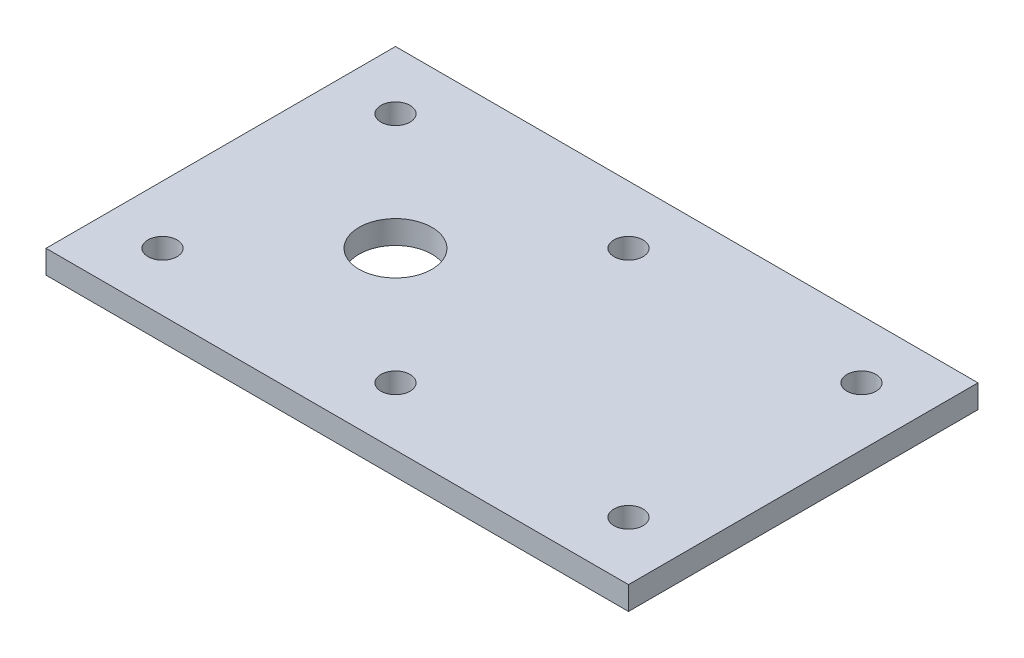
ISO-10303-21;
HEADER;
FILE_DESCRIPTION(('STEP AP214'),'2;1');
FILE_NAME('part.step','',(''),(''),'','','');
FILE_SCHEMA(('AUTOMOTIVE_DESIGN { 1 0 10303 214 1 1 1 1 }'));
ENDSEC;
DATA;
#1=APPLICATION_CONTEXT('core data for automotive mechanical design processes');
#2=APPLICATION_PROTOCOL_DEFINITION('international standard','automotive_design',2000,#1);
#3=PRODUCT_CONTEXT('',#1,'mechanical');
#4=PRODUCT('Part','Part','',(#3));
#5=PRODUCT_RELATED_PRODUCT_CATEGORY('part','',(#4));
#6=PRODUCT_DEFINITION_FORMATION('','',#4);
#7=PRODUCT_DEFINITION_CONTEXT('part definition',#1,'design');
#8=PRODUCT_DEFINITION('design','',#6,#7);
#9=PRODUCT_DEFINITION_SHAPE('','',#8);
#10=(LENGTH_UNIT() NAMED_UNIT(*) SI_UNIT(.MILLI.,.METRE.));
#11=(NAMED_UNIT(*) PLANE_ANGLE_UNIT() SI_UNIT($,.RADIAN.));
#12=(NAMED_UNIT(*) SI_UNIT($,.STERADIAN.) SOLID_ANGLE_UNIT());
#13=UNCERTAINTY_MEASURE_WITH_UNIT(LENGTH_MEASURE(1.E-05),#10,'distance_accuracy_value','');
#14=(GEOMETRIC_REPRESENTATION_CONTEXT(3) GLOBAL_UNCERTAINTY_ASSIGNED_CONTEXT((#13)) GLOBAL_UNIT_ASSIGNED_CONTEXT((#10,
#11,#12)) REPRESENTATION_CONTEXT('',''));
#15=CARTESIAN_POINT('',(0.,0.,0.));
#16=DIRECTION('',(0.,0.,1.));
#17=DIRECTION('',(1.,0.,0.));
#18=AXIS2_PLACEMENT_3D('',#15,#16,#17);
#19=CARTESIAN_POINT('',(120.,0.,40.));
#20=DIRECTION('',(0.,1.,0.));
#21=DIRECTION('',(0.,0.,1.));
#22=AXIS2_PLACEMENT_3D('',#19,#20,#21);
#23=CYLINDRICAL_SURFACE('',#22,5.);
#24=CARTESIAN_POINT('',(120.,0.,40.));
#25=DIRECTION('',(0.,1.,0.));
#26=DIRECTION('',(0.,0.,1.));
#27=AXIS2_PLACEMENT_3D('',#24,#25,#26);
#28=CIRCLE('',#27,5.);
#29=CARTESIAN_POINT('',(120.,0.,45.));
#30=VERTEX_POINT('',#29);
#31=EDGE_CURVE('E45',#30,#30,#28,.T.);
#32=ORIENTED_EDGE('',*,*,#31,.F.);
#33=EDGE_LOOP('',(#32));
#34=FACE_BOUND('',#33,.T.);
#35=CARTESIAN_POINT('',(120.,8.,40.));
#36=DIRECTION('',(0.,1.,0.));
#37=DIRECTION('',(0.,0.,1.));
#38=AXIS2_PLACEMENT_3D('',#35,#36,#37);
#39=CIRCLE('',#38,5.);
#40=CARTESIAN_POINT('',(120.,8.,45.));
#41=VERTEX_POINT('',#40);
#42=EDGE_CURVE('E11',#41,#41,#39,.T.);
#43=ORIENTED_EDGE('',*,*,#42,.T.);
#44=EDGE_LOOP('',(#43));
#45=FACE_BOUND('',#44,.T.);
#46=ADVANCED_FACE('F36',(#34,#45),#23,.F.);
#47=CARTESIAN_POINT('',(120.,0.,-40.));
#48=DIRECTION('',(0.,1.,0.));
#49=DIRECTION('',(0.,0.,1.));
#50=AXIS2_PLACEMENT_3D('',#47,#48,#49);
#51=CYLINDRICAL_SURFACE('',#50,5.);
#52=CARTESIAN_POINT('',(120.,0.,-40.));
#53=DIRECTION('',(0.,1.,0.));
#54=DIRECTION('',(0.,0.,1.));
#55=AXIS2_PLACEMENT_3D('',#52,#53,#54);
#56=CIRCLE('',#55,5.);
#57=CARTESIAN_POINT('',(120.,0.,-35.));
#58=VERTEX_POINT('',#57);
#59=EDGE_CURVE('E127',#58,#58,#56,.T.);
#60=ORIENTED_EDGE('',*,*,#59,.F.);
#61=EDGE_LOOP('',(#60));
#62=FACE_BOUND('',#61,.T.);
#63=CARTESIAN_POINT('',(120.,8.,-40.));
#64=DIRECTION('',(0.,1.,0.));
#65=DIRECTION('',(0.,0.,1.));
#66=AXIS2_PLACEMENT_3D('',#63,#64,#65);
#67=CIRCLE('',#66,5.);
#68=CARTESIAN_POINT('',(120.,8.,-35.));
#69=VERTEX_POINT('',#68);
#70=EDGE_CURVE('E130',#69,#69,#67,.T.);
#71=ORIENTED_EDGE('',*,*,#70,.T.);
#72=EDGE_LOOP('',(#71));
#73=FACE_BOUND('',#72,.T.);
#74=ADVANCED_FACE('F140',(#62,#73),#51,.F.);
#75=CARTESIAN_POINT('',(40.,0.,40.));
#76=DIRECTION('',(0.,1.,0.));
#77=DIRECTION('',(0.,0.,1.));
#78=AXIS2_PLACEMENT_3D('',#75,#76,#77);
#79=CYLINDRICAL_SURFACE('',#78,5.);
#80=CARTESIAN_POINT('',(40.,0.,40.));
#81=DIRECTION('',(0.,1.,0.));
#82=DIRECTION('',(0.,0.,1.));
#83=AXIS2_PLACEMENT_3D('',#80,#81,#82);
#84=CIRCLE('',#83,5.);
#85=CARTESIAN_POINT('',(40.,0.,45.));
#86=VERTEX_POINT('',#85);
#87=EDGE_CURVE('E121',#86,#86,#84,.T.);
#88=ORIENTED_EDGE('',*,*,#87,.F.);
#89=EDGE_LOOP('',(#88));
#90=FACE_BOUND('',#89,.T.);
#91=CARTESIAN_POINT('',(40.,8.,40.));
#92=DIRECTION('',(0.,1.,0.));
#93=DIRECTION('',(0.,0.,1.));
#94=AXIS2_PLACEMENT_3D('',#91,#92,#93);
#95=CIRCLE('',#94,5.);
#96=CARTESIAN_POINT('',(40.,8.,45.));
#97=VERTEX_POINT('',#96);
#98=EDGE_CURVE('E124',#97,#97,#95,.T.);
#99=ORIENTED_EDGE('',*,*,#98,.T.);
#100=EDGE_LOOP('',(#99));
#101=FACE_BOUND('',#100,.T.);
#102=ADVANCED_FACE('F171',(#90,#101),#79,.F.);
#103=CARTESIAN_POINT('',(40.,0.,-40.));
#104=DIRECTION('',(0.,1.,0.));
#105=DIRECTION('',(0.,0.,1.));
#106=AXIS2_PLACEMENT_3D('',#103,#104,#105);
#107=CYLINDRICAL_SURFACE('',#106,5.);
#108=CARTESIAN_POINT('',(40.,0.,-40.));
#109=DIRECTION('',(0.,1.,0.));
#110=DIRECTION('',(0.,0.,1.));
#111=AXIS2_PLACEMENT_3D('',#108,#109,#110);
#112=CIRCLE('',#111,5.);
#113=CARTESIAN_POINT('',(40.,0.,-35.));
#114=VERTEX_POINT('',#113);
#115=EDGE_CURVE('E115',#114,#114,#112,.T.);
#116=ORIENTED_EDGE('',*,*,#115,.F.);
#117=EDGE_LOOP('',(#116));
#118=FACE_BOUND('',#117,.T.);
#119=CARTESIAN_POINT('',(40.,8.,-40.));
#120=DIRECTION('',(0.,1.,0.));
#121=DIRECTION('',(0.,0.,1.));
#122=AXIS2_PLACEMENT_3D('',#119,#120,#121);
#123=CIRCLE('',#122,5.);
#124=CARTESIAN_POINT('',(40.,8.,-35.));
#125=VERTEX_POINT('',#124);
#126=EDGE_CURVE('E118',#125,#125,#123,.T.);
#127=ORIENTED_EDGE('',*,*,#126,.T.);
#128=EDGE_LOOP('',(#127));
#129=FACE_BOUND('',#128,.T.);
#130=ADVANCED_FACE('F167',(#118,#129),#107,.F.);
#131=CARTESIAN_POINT('',(-60.,8.,-60.));
#132=DIRECTION('',(1.,0.,0.));
#133=DIRECTION('',(0.,0.,-1.));
#134=AXIS2_PLACEMENT_3D('',#131,#132,#133);
#135=PLANE('',#134);
#136=DIRECTION('',(0.,0.,1.));
#137=VECTOR('',#136,1.);
#138=CARTESIAN_POINT('',(-60.,0.,-60.));
#139=LINE('',#138,#137);
#140=CARTESIAN_POINT('',(-60.,0.,-60.));
#141=VERTEX_POINT('',#140);
#142=CARTESIAN_POINT('',(-60.,0.,60.));
#143=VERTEX_POINT('',#142);
#144=EDGE_CURVE('E105',#141,#143,#139,.T.);
#145=ORIENTED_EDGE('',*,*,#144,.T.);
#146=DIRECTION('',(0.,-1.,0.));
#147=VECTOR('',#146,1.);
#148=CARTESIAN_POINT('',(-60.,8.,60.));
#149=LINE('',#148,#147);
#150=CARTESIAN_POINT('',(-60.,8.,60.));
#151=VERTEX_POINT('',#150);
#152=EDGE_CURVE('E96',#151,#143,#149,.T.);
#153=ORIENTED_EDGE('',*,*,#152,.F.);
#154=DIRECTION('',(0.,0.,1.));
#155=VECTOR('',#154,1.);
#156=CARTESIAN_POINT('',(-60.,8.,-60.));
#157=LINE('',#156,#155);
#158=CARTESIAN_POINT('',(-60.,8.,-60.));
#159=VERTEX_POINT('',#158);
#160=EDGE_CURVE('E90',#159,#151,#157,.T.);
#161=ORIENTED_EDGE('',*,*,#160,.F.);
#162=DIRECTION('',(0.,-1.,0.));
#163=VECTOR('',#162,1.);
#164=CARTESIAN_POINT('',(-60.,8.,-60.));
#165=LINE('',#164,#163);
#166=EDGE_CURVE('E101',#159,#141,#165,.T.);
#167=ORIENTED_EDGE('',*,*,#166,.T.);
#168=EDGE_LOOP('',(#145,#153,#161,#167));
#169=FACE_BOUND('',#168,.T.);
#170=ADVANCED_FACE('F164',(#169),#135,.F.);
#171=CARTESIAN_POINT('',(140.,8.,60.));
#172=DIRECTION('',(0.,0.,-1.));
#173=DIRECTION('',(-1.,0.,0.));
#174=AXIS2_PLACEMENT_3D('',#171,#172,#173);
#175=PLANE('',#174);
#176=DIRECTION('',(1.,0.,0.));
#177=VECTOR('',#176,1.);
#178=CARTESIAN_POINT('',(140.,0.,60.));
#179=LINE('',#178,#177);
#180=CARTESIAN_POINT('',(140.,0.,60.));
#181=VERTEX_POINT('',#180);
#182=EDGE_CURVE('E95',#143,#181,#179,.T.);
#183=ORIENTED_EDGE('',*,*,#182,.T.);
#184=DIRECTION('',(0.,-1.,0.));
#185=VECTOR('',#184,1.);
#186=CARTESIAN_POINT('',(140.,8.,60.));
#187=LINE('',#186,#185);
#188=CARTESIAN_POINT('',(140.,8.,60.));
#189=VERTEX_POINT('',#188);
#190=EDGE_CURVE('E93',#189,#181,#187,.T.);
#191=ORIENTED_EDGE('',*,*,#190,.F.);
#192=DIRECTION('',(1.,0.,0.));
#193=VECTOR('',#192,1.);
#194=CARTESIAN_POINT('',(140.,8.,60.));
#195=LINE('',#194,#193);
#196=EDGE_CURVE('E84',#151,#189,#195,.T.);
#197=ORIENTED_EDGE('',*,*,#196,.F.);
#198=ORIENTED_EDGE('',*,*,#152,.T.);
#199=EDGE_LOOP('',(#183,#191,#197,#198));
#200=FACE_BOUND('',#199,.T.);
#201=ADVANCED_FACE('F94',(#200),#175,.F.);
#202=CARTESIAN_POINT('',(140.,8.,-60.));
#203=DIRECTION('',(-1.,0.,0.));
#204=DIRECTION('',(0.,0.,1.));
#205=AXIS2_PLACEMENT_3D('',#202,#203,#204);
#206=PLANE('',#205);
#207=DIRECTION('',(0.,0.,-1.));
#208=VECTOR('',#207,1.);
#209=CARTESIAN_POINT('',(140.,0.,-60.));
#210=LINE('',#209,#208);
#211=CARTESIAN_POINT('',(140.,0.,-60.));
#212=VERTEX_POINT('',#211);
#213=EDGE_CURVE('E70',#181,#212,#210,.T.);
#214=ORIENTED_EDGE('',*,*,#213,.T.);
#215=DIRECTION('',(0.,-1.,0.));
#216=VECTOR('',#215,1.);
#217=CARTESIAN_POINT('',(140.,8.,-60.));
#218=LINE('',#217,#216);
#219=CARTESIAN_POINT('',(140.,8.,-60.));
#220=VERTEX_POINT('',#219);
#221=EDGE_CURVE('E97',#220,#212,#218,.T.);
#222=ORIENTED_EDGE('',*,*,#221,.F.);
#223=DIRECTION('',(0.,0.,-1.));
#224=VECTOR('',#223,1.);
#225=CARTESIAN_POINT('',(140.,8.,-60.));
#226=LINE('',#225,#224);
#227=EDGE_CURVE('E88',#189,#220,#226,.T.);
#228=ORIENTED_EDGE('',*,*,#227,.F.);
#229=ORIENTED_EDGE('',*,*,#190,.T.);
#230=EDGE_LOOP('',(#214,#222,#228,#229));
#231=FACE_BOUND('',#230,.T.);
#232=ADVANCED_FACE('F99',(#231),#206,.F.);
#233=CARTESIAN_POINT('',(140.,8.,-60.));
#234=DIRECTION('',(0.,0.,1.));
#235=DIRECTION('',(1.,0.,0.));
#236=AXIS2_PLACEMENT_3D('',#233,#234,#235);
#237=PLANE('',#236);
#238=DIRECTION('',(-1.,0.,0.));
#239=VECTOR('',#238,1.);
#240=CARTESIAN_POINT('',(140.,0.,-60.));
#241=LINE('',#240,#239);
#242=EDGE_CURVE('E76',#212,#141,#241,.T.);
#243=ORIENTED_EDGE('',*,*,#242,.T.);
#244=ORIENTED_EDGE('',*,*,#166,.F.);
#245=DIRECTION('',(-1.,0.,0.));
#246=VECTOR('',#245,1.);
#247=CARTESIAN_POINT('',(140.,8.,-60.));
#248=LINE('',#247,#246);
#249=EDGE_CURVE('E53',#220,#159,#248,.T.);
#250=ORIENTED_EDGE('',*,*,#249,.F.);
#251=ORIENTED_EDGE('',*,*,#221,.T.);
#252=EDGE_LOOP('',(#243,#244,#250,#251));
#253=FACE_BOUND('',#252,.T.);
#254=ADVANCED_FACE('F144',(#253),#237,.F.);
#255=CARTESIAN_POINT('',(0.,8.,0.));
#256=DIRECTION('',(0.,-1.,0.));
#257=DIRECTION('',(0.,0.,-1.));
#258=AXIS2_PLACEMENT_3D('',#255,#256,#257);
#259=PLANE('',#258);
#260=CARTESIAN_POINT('',(0.,8.,0.));
#261=DIRECTION('',(0.,1.,0.));
#262=DIRECTION('',(0.,0.,1.));
#263=AXIS2_PLACEMENT_3D('',#260,#261,#262);
#264=CIRCLE('',#263,12.5);
#265=CARTESIAN_POINT('',(0.,8.,12.5));
#266=VERTEX_POINT('',#265);
#267=EDGE_CURVE('E265',#266,#266,#264,.T.);
#268=ORIENTED_EDGE('',*,*,#267,.F.);
#269=EDGE_LOOP('',(#268));
#270=FACE_BOUND('',#269,.T.);
#271=CARTESIAN_POINT('',(-40.,8.,40.));
#272=DIRECTION('',(0.,1.,0.));
#273=DIRECTION('',(0.,0.,1.));
#274=AXIS2_PLACEMENT_3D('',#271,#272,#273);
#275=CIRCLE('',#274,5.);
#276=CARTESIAN_POINT('',(-40.,8.,45.));
#277=VERTEX_POINT('',#276);
#278=EDGE_CURVE('E271',#277,#277,#275,.T.);
#279=ORIENTED_EDGE('',*,*,#278,.F.);
#280=EDGE_LOOP('',(#279));
#281=FACE_BOUND('',#280,.T.);
#282=CARTESIAN_POINT('',(-40.,8.,-40.));
#283=DIRECTION('',(0.,1.,0.));
#284=DIRECTION('',(0.,0.,1.));
#285=AXIS2_PLACEMENT_3D('',#282,#283,#284);
#286=CIRCLE('',#285,5.);
#287=CARTESIAN_POINT('',(-40.,8.,-35.));
#288=VERTEX_POINT('',#287);
#289=EDGE_CURVE('E274',#288,#288,#286,.T.);
#290=ORIENTED_EDGE('',*,*,#289,.F.);
#291=EDGE_LOOP('',(#290));
#292=FACE_BOUND('',#291,.T.);
#293=ORIENTED_EDGE('',*,*,#160,.T.);
#294=ORIENTED_EDGE('',*,*,#196,.T.);
#295=ORIENTED_EDGE('',*,*,#227,.T.);
#296=ORIENTED_EDGE('',*,*,#249,.T.);
#297=EDGE_LOOP('',(#293,#294,#295,#296));
#298=FACE_BOUND('',#297,.T.);
#299=ORIENTED_EDGE('',*,*,#126,.F.);
#300=EDGE_LOOP('',(#299));
#301=FACE_BOUND('',#300,.T.);
#302=ORIENTED_EDGE('',*,*,#98,.F.);
#303=EDGE_LOOP('',(#302));
#304=FACE_BOUND('',#303,.T.);
#305=ORIENTED_EDGE('',*,*,#70,.F.);
#306=EDGE_LOOP('',(#305));
#307=FACE_BOUND('',#306,.T.);
#308=ORIENTED_EDGE('',*,*,#42,.F.);
#309=EDGE_LOOP('',(#308));
#310=FACE_BOUND('',#309,.T.);
#311=ADVANCED_FACE('F85',(#270,#281,#292,#298,#301,#304,#307,#310),#259,.F.);
#312=CARTESIAN_POINT('',(0.,0.,0.));
#313=DIRECTION('',(0.,-1.,0.));
#314=DIRECTION('',(0.,0.,-1.));
#315=AXIS2_PLACEMENT_3D('',#312,#313,#314);
#316=PLANE('',#315);
#317=CARTESIAN_POINT('',(0.,0.,0.));
#318=DIRECTION('',(0.,-1.,0.));
#319=DIRECTION('',(0.,0.,-1.));
#320=AXIS2_PLACEMENT_3D('',#317,#318,#319);
#321=CIRCLE('',#320,12.5);
#322=CARTESIAN_POINT('',(0.,0.,-12.5));
#323=VERTEX_POINT('',#322);
#324=EDGE_CURVE('E39',#323,#323,#321,.T.);
#325=ORIENTED_EDGE('',*,*,#324,.F.);
#326=EDGE_LOOP('',(#325));
#327=FACE_BOUND('',#326,.T.);
#328=CARTESIAN_POINT('',(-40.,0.,40.));
#329=DIRECTION('',(0.,1.,0.));
#330=DIRECTION('',(0.,0.,1.));
#331=AXIS2_PLACEMENT_3D('',#328,#329,#330);
#332=CIRCLE('',#331,5.);
#333=CARTESIAN_POINT('',(-40.,0.,45.));
#334=VERTEX_POINT('',#333);
#335=EDGE_CURVE('E267',#334,#334,#332,.T.);
#336=ORIENTED_EDGE('',*,*,#335,.T.);
#337=EDGE_LOOP('',(#336));
#338=FACE_BOUND('',#337,.T.);
#339=CARTESIAN_POINT('',(-40.,0.,-40.));
#340=DIRECTION('',(0.,1.,0.));
#341=DIRECTION('',(0.,0.,1.));
#342=AXIS2_PLACEMENT_3D('',#339,#340,#341);
#343=CIRCLE('',#342,5.);
#344=CARTESIAN_POINT('',(-40.,0.,-35.));
#345=VERTEX_POINT('',#344);
#346=EDGE_CURVE('E108',#345,#345,#343,.T.);
#347=ORIENTED_EDGE('',*,*,#346,.T.);
#348=EDGE_LOOP('',(#347));
#349=FACE_BOUND('',#348,.T.);
#350=ORIENTED_EDGE('',*,*,#144,.F.);
#351=ORIENTED_EDGE('',*,*,#242,.F.);
#352=ORIENTED_EDGE('',*,*,#213,.F.);
#353=ORIENTED_EDGE('',*,*,#182,.F.);
#354=EDGE_LOOP('',(#350,#351,#352,#353));
#355=FACE_BOUND('',#354,.T.);
#356=ORIENTED_EDGE('',*,*,#115,.T.);
#357=EDGE_LOOP('',(#356));
#358=FACE_BOUND('',#357,.T.);
#359=ORIENTED_EDGE('',*,*,#87,.T.);
#360=EDGE_LOOP('',(#359));
#361=FACE_BOUND('',#360,.T.);
#362=ORIENTED_EDGE('',*,*,#59,.T.);
#363=EDGE_LOOP('',(#362));
#364=FACE_BOUND('',#363,.T.);
#365=ORIENTED_EDGE('',*,*,#31,.T.);
#366=EDGE_LOOP('',(#365));
#367=FACE_BOUND('',#366,.T.);
#368=ADVANCED_FACE('F136',(#327,#338,#349,#355,#358,#361,#364,#367),#316,.T.);
#369=CARTESIAN_POINT('',(-40.,0.,-40.));
#370=DIRECTION('',(0.,1.,0.));
#371=DIRECTION('',(0.,0.,1.));
#372=AXIS2_PLACEMENT_3D('',#369,#370,#371);
#373=CYLINDRICAL_SURFACE('',#372,5.);
#374=ORIENTED_EDGE('',*,*,#346,.F.);
#375=EDGE_LOOP('',(#374));
#376=FACE_BOUND('',#375,.T.);
#377=ORIENTED_EDGE('',*,*,#289,.T.);
#378=EDGE_LOOP('',(#377));
#379=FACE_BOUND('',#378,.T.);
#380=ADVANCED_FACE('F151',(#376,#379),#373,.F.);
#381=CARTESIAN_POINT('',(-40.,0.,40.));
#382=DIRECTION('',(0.,1.,0.));
#383=DIRECTION('',(0.,0.,1.));
#384=AXIS2_PLACEMENT_3D('',#381,#382,#383);
#385=CYLINDRICAL_SURFACE('',#384,5.);
#386=ORIENTED_EDGE('',*,*,#335,.F.);
#387=EDGE_LOOP('',(#386));
#388=FACE_BOUND('',#387,.T.);
#389=ORIENTED_EDGE('',*,*,#278,.T.);
#390=EDGE_LOOP('',(#389));
#391=FACE_BOUND('',#390,.T.);
#392=ADVANCED_FACE('F220',(#388,#391),#385,.F.);
#393=CARTESIAN_POINT('',(0.,-2.,0.));
#394=DIRECTION('',(0.,1.,0.));
#395=DIRECTION('',(0.,0.,1.));
#396=AXIS2_PLACEMENT_3D('',#393,#394,#395);
#397=CYLINDRICAL_SURFACE('',#396,12.5);
#398=ORIENTED_EDGE('',*,*,#324,.T.);
#399=EDGE_LOOP('',(#398));
#400=FACE_BOUND('',#399,.T.);
#401=ORIENTED_EDGE('',*,*,#267,.T.);
#402=EDGE_LOOP('',(#401));
#403=FACE_BOUND('',#402,.T.);
#404=ADVANCED_FACE('F241',(#400,#403),#397,.F.);
#405=CLOSED_SHELL('',(#46,#74,#102,#130,#170,#201,#232,#254,#311,#368,#380,#392,#404));
#406=MANIFOLD_SOLID_BREP('B2',#405);
#407=ADVANCED_BREP_SHAPE_REPRESENTATION('',(#18,#406),#14);
#408=SHAPE_DEFINITION_REPRESENTATION(#9,#407);
ENDSEC;
END-ISO-10303-21;
